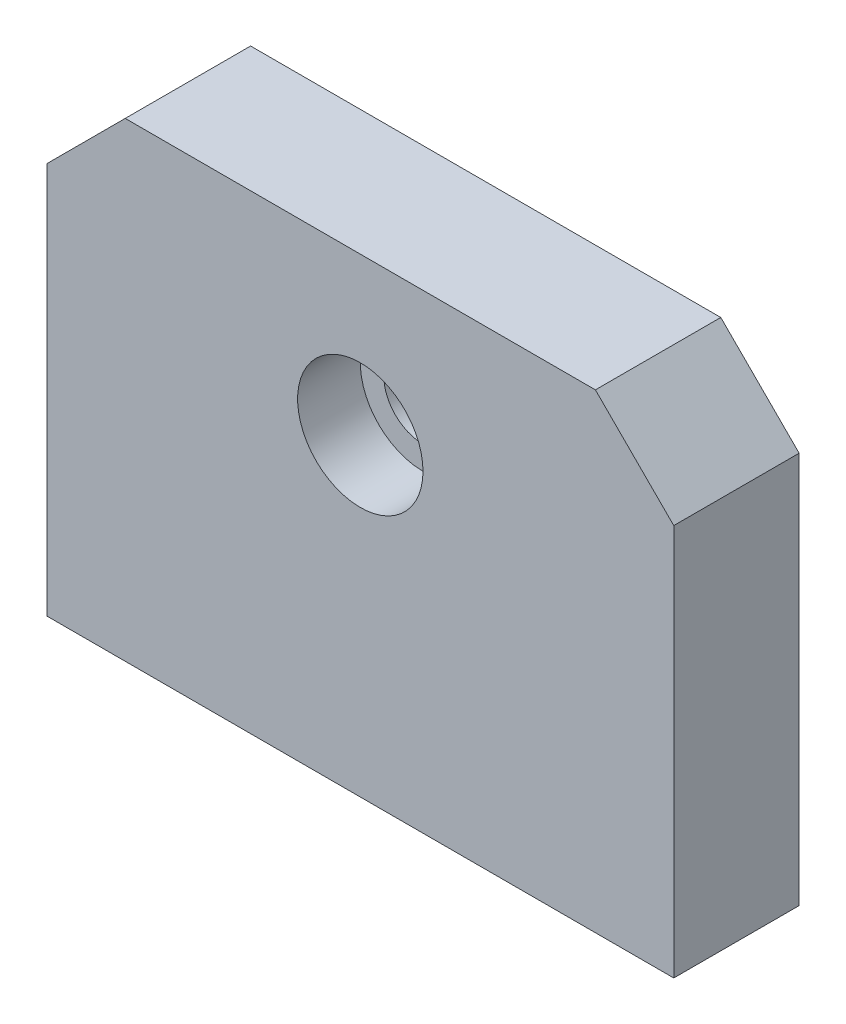
ISO-10303-21;
HEADER;
FILE_DESCRIPTION(('STEP AP214'),'2;1');
FILE_NAME('part.step','',(''),(''),'','','');
FILE_SCHEMA(('AUTOMOTIVE_DESIGN { 1 0 10303 214 1 1 1 1 }'));
ENDSEC;
DATA;
#1=APPLICATION_CONTEXT('core data for automotive mechanical design processes');
#2=APPLICATION_PROTOCOL_DEFINITION('international standard','automotive_design',2000,#1);
#3=PRODUCT_CONTEXT('',#1,'mechanical');
#4=PRODUCT('Part','Part','',(#3));
#5=PRODUCT_RELATED_PRODUCT_CATEGORY('part','',(#4));
#6=PRODUCT_DEFINITION_FORMATION('','',#4);
#7=PRODUCT_DEFINITION_CONTEXT('part definition',#1,'design');
#8=PRODUCT_DEFINITION('design','',#6,#7);
#9=PRODUCT_DEFINITION_SHAPE('','',#8);
#10=(LENGTH_UNIT() NAMED_UNIT(*) SI_UNIT(.MILLI.,.METRE.));
#11=(NAMED_UNIT(*) PLANE_ANGLE_UNIT() SI_UNIT($,.RADIAN.));
#12=(NAMED_UNIT(*) SI_UNIT($,.STERADIAN.) SOLID_ANGLE_UNIT());
#13=UNCERTAINTY_MEASURE_WITH_UNIT(LENGTH_MEASURE(1.E-05),#10,'distance_accuracy_value','');
#14=(GEOMETRIC_REPRESENTATION_CONTEXT(3) GLOBAL_UNCERTAINTY_ASSIGNED_CONTEXT((#13)) GLOBAL_UNIT_ASSIGNED_CONTEXT((#10,
#11,#12)) REPRESENTATION_CONTEXT('',''));
#15=CARTESIAN_POINT('',(0.,0.,0.));
#16=DIRECTION('',(0.,0.,1.));
#17=DIRECTION('',(1.,0.,0.));
#18=AXIS2_PLACEMENT_3D('',#15,#16,#17);
#19=CARTESIAN_POINT('',(0.,0.,8.));
#20=DIRECTION('',(0.,0.,-1.));
#21=DIRECTION('',(-1.,0.,0.));
#22=AXIS2_PLACEMENT_3D('',#19,#20,#21);
#23=CYLINDRICAL_SURFACE('',#22,2.5);
#24=CARTESIAN_POINT('',(0.,0.,0.));
#25=DIRECTION('',(0.,0.,1.));
#26=DIRECTION('',(1.,0.,0.));
#27=AXIS2_PLACEMENT_3D('',#24,#25,#26);
#28=CIRCLE('',#27,2.5);
#29=CARTESIAN_POINT('',(2.5,0.,0.));
#30=VERTEX_POINT('',#29);
#31=EDGE_CURVE('E120',#30,#30,#28,.T.);
#32=ORIENTED_EDGE('',*,*,#31,.F.);
#33=EDGE_LOOP('',(#32));
#34=FACE_BOUND('',#33,.T.);
#35=CARTESIAN_POINT('',(0.,0.,4.));
#36=DIRECTION('',(0.,0.,1.));
#37=DIRECTION('',(1.,0.,0.));
#38=AXIS2_PLACEMENT_3D('',#35,#36,#37);
#39=CIRCLE('',#38,2.5);
#40=CARTESIAN_POINT('',(2.5,0.,4.));
#41=VERTEX_POINT('',#40);
#42=EDGE_CURVE('E34',#41,#41,#39,.T.);
#43=ORIENTED_EDGE('',*,*,#42,.T.);
#44=EDGE_LOOP('',(#43));
#45=FACE_BOUND('',#44,.T.);
#46=ADVANCED_FACE('F30',(#34,#45),#23,.F.);
#47=CARTESIAN_POINT('',(0.,25.,8.));
#48=DIRECTION('',(0.,0.,-1.));
#49=DIRECTION('',(-1.,0.,0.));
#50=AXIS2_PLACEMENT_3D('',#47,#48,#49);
#51=PLANE('',#50);
#52=CARTESIAN_POINT('',(0.,0.,8.));
#53=DIRECTION('',(0.,0.,1.));
#54=DIRECTION('',(1.,0.,0.));
#55=AXIS2_PLACEMENT_3D('',#52,#53,#54);
#56=CIRCLE('',#55,4.);
#57=CARTESIAN_POINT('',(4.,0.,8.));
#58=VERTEX_POINT('',#57);
#59=EDGE_CURVE('E248',#58,#58,#56,.T.);
#60=ORIENTED_EDGE('',*,*,#59,.F.);
#61=EDGE_LOOP('',(#60));
#62=FACE_BOUND('',#61,.T.);
#63=DIRECTION('',(-0.707106781186548,0.707106781186547,0.));
#64=VECTOR('',#63,1.);
#65=CARTESIAN_POINT('',(20.,5.,8.));
#66=LINE('',#65,#64);
#67=CARTESIAN_POINT('',(20.,5.,8.));
#68=VERTEX_POINT('',#67);
#69=CARTESIAN_POINT('',(15.,10.,8.));
#70=VERTEX_POINT('',#69);
#71=EDGE_CURVE('E127',#68,#70,#66,.T.);
#72=ORIENTED_EDGE('',*,*,#71,.T.);
#73=DIRECTION('',(-1.,0.,0.));
#74=VECTOR('',#73,1.);
#75=CARTESIAN_POINT('',(-15.,10.,8.));
#76=LINE('',#75,#74);
#77=CARTESIAN_POINT('',(-15.,10.,8.));
#78=VERTEX_POINT('',#77);
#79=EDGE_CURVE('E85',#70,#78,#76,.T.);
#80=ORIENTED_EDGE('',*,*,#79,.T.);
#81=DIRECTION('',(-0.707106781186548,-0.707106781186548,0.));
#82=VECTOR('',#81,1.);
#83=CARTESIAN_POINT('',(-20.,5.,8.));
#84=LINE('',#83,#82);
#85=CARTESIAN_POINT('',(-20.,5.,8.));
#86=VERTEX_POINT('',#85);
#87=EDGE_CURVE('E98',#78,#86,#84,.T.);
#88=ORIENTED_EDGE('',*,*,#87,.T.);
#89=DIRECTION('',(0.,-1.,0.));
#90=VECTOR('',#89,1.);
#91=CARTESIAN_POINT('',(-20.,-20.,8.));
#92=LINE('',#91,#90);
#93=CARTESIAN_POINT('',(-20.,-20.,8.));
#94=VERTEX_POINT('',#93);
#95=EDGE_CURVE('E92',#86,#94,#92,.T.);
#96=ORIENTED_EDGE('',*,*,#95,.T.);
#97=DIRECTION('',(1.,0.,0.));
#98=VECTOR('',#97,1.);
#99=CARTESIAN_POINT('',(20.,-20.,8.));
#100=LINE('',#99,#98);
#101=CARTESIAN_POINT('',(20.,-20.,8.));
#102=VERTEX_POINT('',#101);
#103=EDGE_CURVE('E96',#94,#102,#100,.T.);
#104=ORIENTED_EDGE('',*,*,#103,.T.);
#105=DIRECTION('',(0.,1.,0.));
#106=VECTOR('',#105,1.);
#107=CARTESIAN_POINT('',(20.,5.,8.));
#108=LINE('',#107,#106);
#109=EDGE_CURVE('E48',#102,#68,#108,.T.);
#110=ORIENTED_EDGE('',*,*,#109,.T.);
#111=EDGE_LOOP('',(#72,#80,#88,#96,#104,#110));
#112=FACE_BOUND('',#111,.T.);
#113=ADVANCED_FACE('F94',(#62,#112),#51,.F.);
#114=CARTESIAN_POINT('',(0.,25.,0.));
#115=DIRECTION('',(0.,0.,-1.));
#116=DIRECTION('',(-1.,0.,0.));
#117=AXIS2_PLACEMENT_3D('',#114,#115,#116);
#118=PLANE('',#117);
#119=DIRECTION('',(-0.707106781186548,0.707106781186547,0.));
#120=VECTOR('',#119,1.);
#121=CARTESIAN_POINT('',(20.,5.,0.));
#122=LINE('',#121,#120);
#123=CARTESIAN_POINT('',(20.,5.,0.));
#124=VERTEX_POINT('',#123);
#125=CARTESIAN_POINT('',(15.,10.,0.));
#126=VERTEX_POINT('',#125);
#127=EDGE_CURVE('E116',#124,#126,#122,.T.);
#128=ORIENTED_EDGE('',*,*,#127,.F.);
#129=DIRECTION('',(0.,1.,0.));
#130=VECTOR('',#129,1.);
#131=CARTESIAN_POINT('',(20.,5.,0.));
#132=LINE('',#131,#130);
#133=CARTESIAN_POINT('',(20.,-20.,0.));
#134=VERTEX_POINT('',#133);
#135=EDGE_CURVE('E77',#134,#124,#132,.T.);
#136=ORIENTED_EDGE('',*,*,#135,.F.);
#137=DIRECTION('',(1.,0.,0.));
#138=VECTOR('',#137,1.);
#139=CARTESIAN_POINT('',(20.,-20.,0.));
#140=LINE('',#139,#138);
#141=CARTESIAN_POINT('',(-20.,-20.,0.));
#142=VERTEX_POINT('',#141);
#143=EDGE_CURVE('E71',#142,#134,#140,.T.);
#144=ORIENTED_EDGE('',*,*,#143,.F.);
#145=DIRECTION('',(0.,-1.,0.));
#146=VECTOR('',#145,1.);
#147=CARTESIAN_POINT('',(-20.,-20.,0.));
#148=LINE('',#147,#146);
#149=CARTESIAN_POINT('',(-20.,5.,0.));
#150=VERTEX_POINT('',#149);
#151=EDGE_CURVE('E106',#150,#142,#148,.T.);
#152=ORIENTED_EDGE('',*,*,#151,.F.);
#153=DIRECTION('',(-0.707106781186548,-0.707106781186548,0.));
#154=VECTOR('',#153,1.);
#155=CARTESIAN_POINT('',(-20.,5.,0.));
#156=LINE('',#155,#154);
#157=CARTESIAN_POINT('',(-15.,10.,0.));
#158=VERTEX_POINT('',#157);
#159=EDGE_CURVE('E122',#158,#150,#156,.T.);
#160=ORIENTED_EDGE('',*,*,#159,.F.);
#161=DIRECTION('',(-1.,0.,0.));
#162=VECTOR('',#161,1.);
#163=CARTESIAN_POINT('',(-15.,10.,0.));
#164=LINE('',#163,#162);
#165=EDGE_CURVE('E119',#126,#158,#164,.T.);
#166=ORIENTED_EDGE('',*,*,#165,.F.);
#167=EDGE_LOOP('',(#128,#136,#144,#152,#160,#166));
#168=FACE_BOUND('',#167,.T.);
#169=ORIENTED_EDGE('',*,*,#31,.T.);
#170=EDGE_LOOP('',(#169));
#171=FACE_BOUND('',#170,.T.);
#172=ADVANCED_FACE('F137',(#168,#171),#118,.T.);
#173=CARTESIAN_POINT('',(20.,5.,8.));
#174=DIRECTION('',(-0.707106781186547,-0.707106781186548,0.));
#175=DIRECTION('',(0.707106781186548,-0.707106781186547,0.));
#176=AXIS2_PLACEMENT_3D('',#173,#174,#175);
#177=PLANE('',#176);
#178=ORIENTED_EDGE('',*,*,#127,.T.);
#179=DIRECTION('',(0.,0.,-1.));
#180=VECTOR('',#179,1.);
#181=CARTESIAN_POINT('',(15.,10.,8.));
#182=LINE('',#181,#180);
#183=EDGE_CURVE('E11',#70,#126,#182,.T.);
#184=ORIENTED_EDGE('',*,*,#183,.F.);
#185=ORIENTED_EDGE('',*,*,#71,.F.);
#186=DIRECTION('',(0.,0.,-1.));
#187=VECTOR('',#186,1.);
#188=CARTESIAN_POINT('',(20.,5.,8.));
#189=LINE('',#188,#187);
#190=EDGE_CURVE('E112',#68,#124,#189,.T.);
#191=ORIENTED_EDGE('',*,*,#190,.T.);
#192=EDGE_LOOP('',(#178,#184,#185,#191));
#193=FACE_BOUND('',#192,.T.);
#194=ADVANCED_FACE('F32',(#193),#177,.F.);
#195=CARTESIAN_POINT('',(-15.,10.,8.));
#196=DIRECTION('',(0.,-1.,0.));
#197=DIRECTION('',(1.,0.,0.));
#198=AXIS2_PLACEMENT_3D('',#195,#196,#197);
#199=PLANE('',#198);
#200=ORIENTED_EDGE('',*,*,#165,.T.);
#201=DIRECTION('',(0.,0.,-1.));
#202=VECTOR('',#201,1.);
#203=CARTESIAN_POINT('',(-15.,10.,8.));
#204=LINE('',#203,#202);
#205=EDGE_CURVE('E40',#78,#158,#204,.T.);
#206=ORIENTED_EDGE('',*,*,#205,.F.);
#207=ORIENTED_EDGE('',*,*,#79,.F.);
#208=ORIENTED_EDGE('',*,*,#183,.T.);
#209=EDGE_LOOP('',(#200,#206,#207,#208));
#210=FACE_BOUND('',#209,.T.);
#211=ADVANCED_FACE('F171',(#210),#199,.F.);
#212=CARTESIAN_POINT('',(-20.,5.,8.));
#213=DIRECTION('',(0.707106781186547,-0.707106781186547,0.));
#214=DIRECTION('',(0.707106781186548,0.707106781186548,0.));
#215=AXIS2_PLACEMENT_3D('',#212,#213,#214);
#216=PLANE('',#215);
#217=ORIENTED_EDGE('',*,*,#159,.T.);
#218=DIRECTION('',(0.,0.,-1.));
#219=VECTOR('',#218,1.);
#220=CARTESIAN_POINT('',(-20.,5.,8.));
#221=LINE('',#220,#219);
#222=EDGE_CURVE('E107',#86,#150,#221,.T.);
#223=ORIENTED_EDGE('',*,*,#222,.F.);
#224=ORIENTED_EDGE('',*,*,#87,.F.);
#225=ORIENTED_EDGE('',*,*,#205,.T.);
#226=EDGE_LOOP('',(#217,#223,#224,#225));
#227=FACE_BOUND('',#226,.T.);
#228=ADVANCED_FACE('F134',(#227),#216,.F.);
#229=CARTESIAN_POINT('',(-20.,-20.,8.));
#230=DIRECTION('',(1.,0.,0.));
#231=DIRECTION('',(0.,0.,-1.));
#232=AXIS2_PLACEMENT_3D('',#229,#230,#231);
#233=PLANE('',#232);
#234=ORIENTED_EDGE('',*,*,#151,.T.);
#235=DIRECTION('',(0.,0.,-1.));
#236=VECTOR('',#235,1.);
#237=CARTESIAN_POINT('',(-20.,-20.,8.));
#238=LINE('',#237,#236);
#239=EDGE_CURVE('E103',#94,#142,#238,.T.);
#240=ORIENTED_EDGE('',*,*,#239,.F.);
#241=ORIENTED_EDGE('',*,*,#95,.F.);
#242=ORIENTED_EDGE('',*,*,#222,.T.);
#243=EDGE_LOOP('',(#234,#240,#241,#242));
#244=FACE_BOUND('',#243,.T.);
#245=ADVANCED_FACE('F104',(#244),#233,.F.);
#246=CARTESIAN_POINT('',(20.,-20.,8.));
#247=DIRECTION('',(0.,1.,0.));
#248=DIRECTION('',(-1.,0.,0.));
#249=AXIS2_PLACEMENT_3D('',#246,#247,#248);
#250=PLANE('',#249);
#251=CARTESIAN_POINT('',(15.5,-20.,4.));
#252=DIRECTION('',(0.,-1.,0.));
#253=DIRECTION('',(1.,0.,0.));
#254=AXIS2_PLACEMENT_3D('',#251,#252,#253);
#255=CIRCLE('',#254,2.);
#256=CARTESIAN_POINT('',(17.5,-20.,4.));
#257=VERTEX_POINT('',#256);
#258=EDGE_CURVE('E264',#257,#257,#255,.T.);
#259=ORIENTED_EDGE('',*,*,#258,.F.);
#260=EDGE_LOOP('',(#259));
#261=FACE_BOUND('',#260,.T.);
#262=CARTESIAN_POINT('',(-15.5,-20.,4.));
#263=DIRECTION('',(0.,-1.,0.));
#264=DIRECTION('',(1.,0.,0.));
#265=AXIS2_PLACEMENT_3D('',#262,#263,#264);
#266=CIRCLE('',#265,2.);
#267=CARTESIAN_POINT('',(-13.5,-20.,4.));
#268=VERTEX_POINT('',#267);
#269=EDGE_CURVE('E254',#268,#268,#266,.T.);
#270=ORIENTED_EDGE('',*,*,#269,.F.);
#271=EDGE_LOOP('',(#270));
#272=FACE_BOUND('',#271,.T.);
#273=ORIENTED_EDGE('',*,*,#143,.T.);
#274=DIRECTION('',(0.,0.,-1.));
#275=VECTOR('',#274,1.);
#276=CARTESIAN_POINT('',(20.,-20.,8.));
#277=LINE('',#276,#275);
#278=EDGE_CURVE('E108',#102,#134,#277,.T.);
#279=ORIENTED_EDGE('',*,*,#278,.F.);
#280=ORIENTED_EDGE('',*,*,#103,.F.);
#281=ORIENTED_EDGE('',*,*,#239,.T.);
#282=EDGE_LOOP('',(#273,#279,#280,#281));
#283=FACE_BOUND('',#282,.T.);
#284=ADVANCED_FACE('F110',(#261,#272,#283),#250,.F.);
#285=CARTESIAN_POINT('',(20.,5.,8.));
#286=DIRECTION('',(-1.,0.,0.));
#287=DIRECTION('',(0.,-1.,0.));
#288=AXIS2_PLACEMENT_3D('',#285,#286,#287);
#289=PLANE('',#288);
#290=ORIENTED_EDGE('',*,*,#135,.T.);
#291=ORIENTED_EDGE('',*,*,#190,.F.);
#292=ORIENTED_EDGE('',*,*,#109,.F.);
#293=ORIENTED_EDGE('',*,*,#278,.T.);
#294=EDGE_LOOP('',(#290,#291,#292,#293));
#295=FACE_BOUND('',#294,.T.);
#296=ADVANCED_FACE('F142',(#295),#289,.F.);
#297=CARTESIAN_POINT('',(0.,0.,4.));
#298=DIRECTION('',(0.,0.,1.));
#299=DIRECTION('',(1.,0.,0.));
#300=AXIS2_PLACEMENT_3D('',#297,#298,#299);
#301=CYLINDRICAL_SURFACE('',#300,4.);
#302=CARTESIAN_POINT('',(0.,0.,4.));
#303=DIRECTION('',(0.,0.,1.));
#304=DIRECTION('',(1.,0.,0.));
#305=AXIS2_PLACEMENT_3D('',#302,#303,#304);
#306=CIRCLE('',#305,4.);
#307=CARTESIAN_POINT('',(4.,0.,4.));
#308=VERTEX_POINT('',#307);
#309=EDGE_CURVE('E247',#308,#308,#306,.T.);
#310=ORIENTED_EDGE('',*,*,#309,.F.);
#311=EDGE_LOOP('',(#310));
#312=FACE_BOUND('',#311,.T.);
#313=ORIENTED_EDGE('',*,*,#59,.T.);
#314=EDGE_LOOP('',(#313));
#315=FACE_BOUND('',#314,.T.);
#316=ADVANCED_FACE('F144',(#312,#315),#301,.F.);
#317=CARTESIAN_POINT('',(0.,0.,4.));
#318=DIRECTION('',(0.,0.,1.));
#319=DIRECTION('',(1.,0.,0.));
#320=AXIS2_PLACEMENT_3D('',#317,#318,#319);
#321=PLANE('',#320);
#322=ORIENTED_EDGE('',*,*,#42,.F.);
#323=EDGE_LOOP('',(#322));
#324=FACE_BOUND('',#323,.T.);
#325=ORIENTED_EDGE('',*,*,#309,.T.);
#326=EDGE_LOOP('',(#325));
#327=FACE_BOUND('',#326,.T.);
#328=ADVANCED_FACE('F150',(#324,#327),#321,.T.);
#329=CARTESIAN_POINT('',(-15.5,-5.,4.));
#330=DIRECTION('',(0.,-1.,0.));
#331=DIRECTION('',(1.,0.,0.));
#332=AXIS2_PLACEMENT_3D('',#329,#330,#331);
#333=CYLINDRICAL_SURFACE('',#332,2.);
#334=CARTESIAN_POINT('',(-15.5,-5.,4.));
#335=DIRECTION('',(0.,-1.,0.));
#336=DIRECTION('',(1.,0.,0.));
#337=AXIS2_PLACEMENT_3D('',#334,#335,#336);
#338=CIRCLE('',#337,2.);
#339=CARTESIAN_POINT('',(-13.5,-5.,4.));
#340=VERTEX_POINT('',#339);
#341=EDGE_CURVE('E251',#340,#340,#338,.T.);
#342=ORIENTED_EDGE('',*,*,#341,.F.);
#343=EDGE_LOOP('',(#342));
#344=FACE_BOUND('',#343,.T.);
#345=ORIENTED_EDGE('',*,*,#269,.T.);
#346=EDGE_LOOP('',(#345));
#347=FACE_BOUND('',#346,.T.);
#348=ADVANCED_FACE('F200',(#344,#347),#333,.F.);
#349=CARTESIAN_POINT('',(-15.5,-5.,4.));
#350=DIRECTION('',(0.,-1.,0.));
#351=DIRECTION('',(1.,0.,0.));
#352=AXIS2_PLACEMENT_3D('',#349,#350,#351);
#353=PLANE('',#352);
#354=ORIENTED_EDGE('',*,*,#341,.T.);
#355=EDGE_LOOP('',(#354));
#356=FACE_BOUND('',#355,.T.);
#357=ADVANCED_FACE('F205',(#356),#353,.T.);
#358=CARTESIAN_POINT('',(15.5,-5.,4.));
#359=DIRECTION('',(0.,-1.,0.));
#360=DIRECTION('',(1.,0.,0.));
#361=AXIS2_PLACEMENT_3D('',#358,#359,#360);
#362=CYLINDRICAL_SURFACE('',#361,2.);
#363=CARTESIAN_POINT('',(15.5,-5.,4.));
#364=DIRECTION('',(0.,-1.,0.));
#365=DIRECTION('',(1.,0.,0.));
#366=AXIS2_PLACEMENT_3D('',#363,#364,#365);
#367=CIRCLE('',#366,2.);
#368=CARTESIAN_POINT('',(17.5,-5.,4.));
#369=VERTEX_POINT('',#368);
#370=EDGE_CURVE('E261',#369,#369,#367,.T.);
#371=ORIENTED_EDGE('',*,*,#370,.F.);
#372=EDGE_LOOP('',(#371));
#373=FACE_BOUND('',#372,.T.);
#374=ORIENTED_EDGE('',*,*,#258,.T.);
#375=EDGE_LOOP('',(#374));
#376=FACE_BOUND('',#375,.T.);
#377=ADVANCED_FACE('F215',(#373,#376),#362,.F.);
#378=CARTESIAN_POINT('',(15.5,-5.,4.));
#379=DIRECTION('',(0.,-1.,0.));
#380=DIRECTION('',(1.,0.,0.));
#381=AXIS2_PLACEMENT_3D('',#378,#379,#380);
#382=PLANE('',#381);
#383=ORIENTED_EDGE('',*,*,#370,.T.);
#384=EDGE_LOOP('',(#383));
#385=FACE_BOUND('',#384,.T.);
#386=ADVANCED_FACE('F225',(#385),#382,.T.);
#387=CLOSED_SHELL('',(#46,#113,#172,#194,#211,#228,#245,#284,#296,#316,#328,#348,#357,#377,#386));
#388=MANIFOLD_SOLID_BREP('B2',#387);
#389=ADVANCED_BREP_SHAPE_REPRESENTATION('',(#18,#388),#14);
#390=SHAPE_DEFINITION_REPRESENTATION(#9,#389);
ENDSEC;
END-ISO-10303-21;
